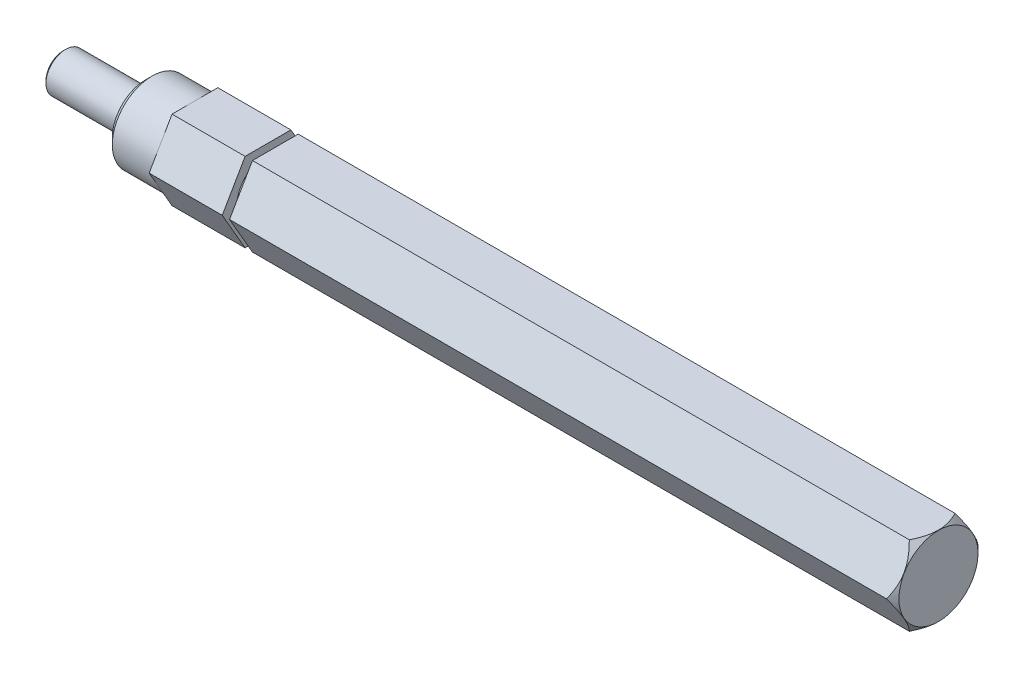
ISO-10303-21;
HEADER;
FILE_DESCRIPTION(('STEP AP214'),'2;1');
FILE_NAME('part.step','',(''),(''),'','','');
FILE_SCHEMA(('AUTOMOTIVE_DESIGN { 1 0 10303 214 1 1 1 1 }'));
ENDSEC;
DATA;
#1=APPLICATION_CONTEXT('core data for automotive mechanical design processes');
#2=APPLICATION_PROTOCOL_DEFINITION('international standard','automotive_design',2000,#1);
#3=PRODUCT_CONTEXT('',#1,'mechanical');
#4=PRODUCT('Part','Part','',(#3));
#5=PRODUCT_RELATED_PRODUCT_CATEGORY('part','',(#4));
#6=PRODUCT_DEFINITION_FORMATION('','',#4);
#7=PRODUCT_DEFINITION_CONTEXT('part definition',#1,'design');
#8=PRODUCT_DEFINITION('design','',#6,#7);
#9=PRODUCT_DEFINITION_SHAPE('','',#8);
#10=(LENGTH_UNIT() NAMED_UNIT(*) SI_UNIT(.MILLI.,.METRE.));
#11=(NAMED_UNIT(*) PLANE_ANGLE_UNIT() SI_UNIT($,.RADIAN.));
#12=(NAMED_UNIT(*) SI_UNIT($,.STERADIAN.) SOLID_ANGLE_UNIT());
#13=UNCERTAINTY_MEASURE_WITH_UNIT(LENGTH_MEASURE(1.E-05),#10,'distance_accuracy_value','');
#14=(GEOMETRIC_REPRESENTATION_CONTEXT(3) GLOBAL_UNCERTAINTY_ASSIGNED_CONTEXT((#13)) GLOBAL_UNIT_ASSIGNED_CONTEXT((#10,
#11,#12)) REPRESENTATION_CONTEXT('',''));
#15=CARTESIAN_POINT('',(0.,0.,0.));
#16=DIRECTION('',(0.,0.,1.));
#17=DIRECTION('',(1.,0.,0.));
#18=AXIS2_PLACEMENT_3D('',#15,#16,#17);
#19=CARTESIAN_POINT('',(-76.708,0.,0.));
#20=DIRECTION('',(-1.,0.,0.));
#21=DIRECTION('',(0.,0.,1.));
#22=AXIS2_PLACEMENT_3D('',#19,#20,#21);
#23=PLANE('',#22);
#24=CARTESIAN_POINT('',(-76.7079999999964,0.,0.));
#25=DIRECTION('',(1.,0.,0.));
#26=DIRECTION('',(0.,0.,-1.));
#27=AXIS2_PLACEMENT_3D('',#24,#25,#26);
#28=CIRCLE('',#27,2.76860000002443);
#29=CARTESIAN_POINT('',(-76.7079999999964,0.,-2.76860000002443));
#30=VERTEX_POINT('',#29);
#31=EDGE_CURVE('E21',#30,#30,#28,.T.);
#32=ORIENTED_EDGE('',*,*,#31,.F.);
#33=EDGE_LOOP('',(#32));
#34=FACE_BOUND('',#33,.T.);
#35=ADVANCED_FACE('F18',(#34),#23,.T.);
#36=CARTESIAN_POINT('',(-76.326999999992,0.,0.));
#37=DIRECTION('',(1.,0.,0.));
#38=DIRECTION('',(0.,0.,-1.));
#39=AXIS2_PLACEMENT_3D('',#36,#37,#38);
#40=CONICAL_SURFACE('',#39,3.149599999972,0.785398163322851);
#41=ORIENTED_EDGE('',*,*,#31,.T.);
#42=EDGE_LOOP('',(#41));
#43=FACE_BOUND('',#42,.T.);
#44=CARTESIAN_POINT('',(-76.327,0.,0.));
#45=DIRECTION('',(1.,0.,0.));
#46=DIRECTION('',(0.,0.,-1.));
#47=AXIS2_PLACEMENT_3D('',#44,#45,#46);
#48=CIRCLE('',#47,3.1496);
#49=CARTESIAN_POINT('',(-76.327,0.,-3.1496));
#50=VERTEX_POINT('',#49);
#51=EDGE_CURVE('E134',#50,#50,#48,.T.);
#52=ORIENTED_EDGE('',*,*,#51,.F.);
#53=EDGE_LOOP('',(#52));
#54=FACE_BOUND('',#53,.T.);
#55=ADVANCED_FACE('F260',(#43,#54),#40,.T.);
#56=CARTESIAN_POINT('',(-76.708,0.,0.));
#57=DIRECTION('',(1.,0.,0.));
#58=DIRECTION('',(0.,0.,-1.));
#59=AXIS2_PLACEMENT_3D('',#56,#57,#58);
#60=CYLINDRICAL_SURFACE('',#59,3.1496);
#61=ORIENTED_EDGE('',*,*,#51,.T.);
#62=EDGE_LOOP('',(#61));
#63=FACE_BOUND('',#62,.T.);
#64=CARTESIAN_POINT('',(-63.5,0.,0.));
#65=DIRECTION('',(1.,0.,0.));
#66=DIRECTION('',(0.,0.,-1.));
#67=AXIS2_PLACEMENT_3D('',#64,#65,#66);
#68=CIRCLE('',#67,3.1496);
#69=CARTESIAN_POINT('',(-63.5,0.,-3.1496));
#70=VERTEX_POINT('',#69);
#71=EDGE_CURVE('E137',#70,#70,#68,.F.);
#72=ORIENTED_EDGE('',*,*,#71,.T.);
#73=EDGE_LOOP('',(#72));
#74=FACE_BOUND('',#73,.T.);
#75=ADVANCED_FACE('F257',(#63,#74),#60,.T.);
#76=CARTESIAN_POINT('',(-63.5,0.,-7.33234841870824));
#77=DIRECTION('',(1.,0.,0.));
#78=DIRECTION('',(0.,0.,-1.));
#79=AXIS2_PLACEMENT_3D('',#76,#77,#78);
#80=PLANE('',#79);
#81=ORIENTED_EDGE('',*,*,#71,.F.);
#82=EDGE_LOOP('',(#81));
#83=FACE_BOUND('',#82,.T.);
#84=CARTESIAN_POINT('',(-63.4999999999764,0.,0.));
#85=DIRECTION('',(1.,0.,0.));
#86=DIRECTION('',(0.,0.,-1.));
#87=AXIS2_PLACEMENT_3D('',#84,#85,#86);
#88=CIRCLE('',#87,5.35000000002128);
#89=CARTESIAN_POINT('',(-63.4999999999764,0.,-5.35000000002128));
#90=VERTEX_POINT('',#89);
#91=EDGE_CURVE('E133',#90,#90,#88,.T.);
#92=ORIENTED_EDGE('',*,*,#91,.F.);
#93=EDGE_LOOP('',(#92));
#94=FACE_BOUND('',#93,.T.);
#95=ADVANCED_FACE('F253',(#83,#94),#80,.F.);
#96=CARTESIAN_POINT('',(-62.5000000001137,0.,0.));
#97=DIRECTION('',(1.,0.,0.));
#98=DIRECTION('',(0.,0.,-1.));
#99=AXIS2_PLACEMENT_3D('',#96,#97,#98);
#100=CONICAL_SURFACE('',#99,6.34999999988395,0.785398163397448);
#101=ORIENTED_EDGE('',*,*,#91,.T.);
#102=EDGE_LOOP('',(#101));
#103=FACE_BOUND('',#102,.T.);
#104=CARTESIAN_POINT('',(-62.5,0.,0.));
#105=DIRECTION('',(-1.,0.,0.));
#106=DIRECTION('',(0.,0.,1.));
#107=AXIS2_PLACEMENT_3D('',#104,#105,#106);
#108=CIRCLE('',#107,6.35);
#109=CARTESIAN_POINT('',(-62.5,0.,6.35));
#110=VERTEX_POINT('',#109);
#111=EDGE_CURVE('E97',#110,#110,#108,.F.);
#112=ORIENTED_EDGE('',*,*,#111,.F.);
#113=EDGE_LOOP('',(#112));
#114=FACE_BOUND('',#113,.T.);
#115=ADVANCED_FACE('F250',(#103,#114),#100,.T.);
#116=CARTESIAN_POINT('',(-55.6133,0.,0.));
#117=DIRECTION('',(-1.,0.,0.));
#118=DIRECTION('',(0.,0.,1.));
#119=AXIS2_PLACEMENT_3D('',#116,#117,#118);
#120=CYLINDRICAL_SURFACE('',#119,6.35);
#121=CARTESIAN_POINT('',(-55.6133,0.,0.));
#122=DIRECTION('',(-1.,0.,0.));
#123=DIRECTION('',(0.,0.,1.));
#124=AXIS2_PLACEMENT_3D('',#121,#122,#123);
#125=CIRCLE('',#124,6.35);
#126=CARTESIAN_POINT('',(-55.6133,-3.17499999999999,-5.49926131403119));
#127=VERTEX_POINT('',#126);
#128=CARTESIAN_POINT('',(-55.6133,3.175,-5.49926131403119));
#129=VERTEX_POINT('',#128);
#130=EDGE_CURVE('E83',#127,#129,#125,.F.);
#131=ORIENTED_EDGE('',*,*,#130,.F.);
#132=CARTESIAN_POINT('',(-55.6133,0.,0.));
#133=DIRECTION('',(-1.,0.,0.));
#134=DIRECTION('',(0.,0.,1.));
#135=AXIS2_PLACEMENT_3D('',#132,#133,#134);
#136=CIRCLE('',#135,6.35);
#137=CARTESIAN_POINT('',(-55.6133,-6.35000000000001,0.));
#138=VERTEX_POINT('',#137);
#139=EDGE_CURVE('E92',#138,#127,#136,.F.);
#140=ORIENTED_EDGE('',*,*,#139,.F.);
#141=CARTESIAN_POINT('',(-55.6133,0.,0.));
#142=DIRECTION('',(-1.,0.,0.));
#143=DIRECTION('',(0.,0.,1.));
#144=AXIS2_PLACEMENT_3D('',#141,#142,#143);
#145=CIRCLE('',#144,6.35);
#146=CARTESIAN_POINT('',(-55.6133,-3.175,5.49926131403118));
#147=VERTEX_POINT('',#146);
#148=EDGE_CURVE('E107',#147,#138,#145,.F.);
#149=ORIENTED_EDGE('',*,*,#148,.F.);
#150=CARTESIAN_POINT('',(-55.6133,0.,0.));
#151=DIRECTION('',(-1.,0.,0.));
#152=DIRECTION('',(0.,0.,1.));
#153=AXIS2_PLACEMENT_3D('',#150,#151,#152);
#154=CIRCLE('',#153,6.35);
#155=CARTESIAN_POINT('',(-55.6133,3.17499999999999,5.49926131403118));
#156=VERTEX_POINT('',#155);
#157=EDGE_CURVE('E108',#156,#147,#154,.F.);
#158=ORIENTED_EDGE('',*,*,#157,.F.);
#159=CARTESIAN_POINT('',(-55.6133,0.,0.));
#160=DIRECTION('',(-1.,0.,0.));
#161=DIRECTION('',(0.,0.,1.));
#162=AXIS2_PLACEMENT_3D('',#159,#160,#161);
#163=CIRCLE('',#162,6.35);
#164=CARTESIAN_POINT('',(-55.6133,6.35,0.));
#165=VERTEX_POINT('',#164);
#166=EDGE_CURVE('E458',#165,#156,#163,.F.);
#167=ORIENTED_EDGE('',*,*,#166,.F.);
#168=CARTESIAN_POINT('',(-55.6133,0.,0.));
#169=DIRECTION('',(-1.,0.,0.));
#170=DIRECTION('',(0.,0.,1.));
#171=AXIS2_PLACEMENT_3D('',#168,#169,#170);
#172=CIRCLE('',#171,6.35);
#173=EDGE_CURVE('E95',#129,#165,#172,.F.);
#174=ORIENTED_EDGE('',*,*,#173,.F.);
#175=EDGE_LOOP('',(#131,#140,#149,#158,#167,#174));
#176=FACE_BOUND('',#175,.T.);
#177=ORIENTED_EDGE('',*,*,#111,.T.);
#178=EDGE_LOOP('',(#177));
#179=FACE_BOUND('',#178,.T.);
#180=ADVANCED_FACE('F89',(#176,#179),#120,.T.);
#181=CARTESIAN_POINT('',(-55.6133,0.,0.));
#182=DIRECTION('',(-1.,0.,0.));
#183=DIRECTION('',(0.,0.,1.));
#184=AXIS2_PLACEMENT_3D('',#181,#182,#183);
#185=PLANE('',#184);
#186=DIRECTION('',(0.,-0.86602540378444,0.499999999999999));
#187=VECTOR('',#186,1.);
#188=CARTESIAN_POINT('',(-55.6133000000001,-6.35000000000002,-3.66617420935411));
#189=LINE('',#188,#187);
#190=CARTESIAN_POINT('',(-55.6133000000001,0.,-7.33234841870823));
#191=VERTEX_POINT('',#190);
#192=EDGE_CURVE('E114',#191,#127,#189,.T.);
#193=ORIENTED_EDGE('',*,*,#192,.T.);
#194=ORIENTED_EDGE('',*,*,#130,.T.);
#195=DIRECTION('',(0.,-0.866025403784439,-0.5));
#196=VECTOR('',#195,1.);
#197=CARTESIAN_POINT('',(-55.6133000000001,0.,-7.33234841870824));
#198=LINE('',#197,#196);
#199=EDGE_CURVE('E122',#129,#191,#198,.T.);
#200=ORIENTED_EDGE('',*,*,#199,.T.);
#201=EDGE_LOOP('',(#193,#194,#200));
#202=FACE_BOUND('',#201,.T.);
#203=ADVANCED_FACE('F121',(#202),#185,.T.);
#204=CARTESIAN_POINT('',(-55.6133,0.,0.));
#205=DIRECTION('',(-1.,0.,0.));
#206=DIRECTION('',(0.,0.,1.));
#207=AXIS2_PLACEMENT_3D('',#204,#205,#206);
#208=PLANE('',#207);
#209=DIRECTION('',(0.,-0.866025403784439,-0.5));
#210=VECTOR('',#209,1.);
#211=CARTESIAN_POINT('',(-55.6133000000001,0.,-7.33234841870824));
#212=LINE('',#211,#210);
#213=CARTESIAN_POINT('',(-55.6133,6.35000000000001,-3.66617420935409));
#214=VERTEX_POINT('',#213);
#215=EDGE_CURVE('E119',#214,#129,#212,.T.);
#216=ORIENTED_EDGE('',*,*,#215,.T.);
#217=ORIENTED_EDGE('',*,*,#173,.T.);
#218=DIRECTION('',(0.,0.,-1.));
#219=VECTOR('',#218,1.);
#220=CARTESIAN_POINT('',(-55.6133,6.35,-3.66617420935412));
#221=LINE('',#220,#219);
#222=EDGE_CURVE('E417',#165,#214,#221,.T.);
#223=ORIENTED_EDGE('',*,*,#222,.T.);
#224=EDGE_LOOP('',(#216,#217,#223));
#225=FACE_BOUND('',#224,.T.);
#226=ADVANCED_FACE('F241',(#225),#208,.T.);
#227=CARTESIAN_POINT('',(-55.6133,0.,0.));
#228=DIRECTION('',(-1.,0.,0.));
#229=DIRECTION('',(0.,0.,1.));
#230=AXIS2_PLACEMENT_3D('',#227,#228,#229);
#231=PLANE('',#230);
#232=ORIENTED_EDGE('',*,*,#166,.T.);
#233=DIRECTION('',(0.,0.866025403784439,-0.499999999999999));
#234=VECTOR('',#233,1.);
#235=CARTESIAN_POINT('',(-55.6133,6.35,3.6661742093541));
#236=LINE('',#235,#234);
#237=CARTESIAN_POINT('',(-55.6133,6.34999999999999,3.66617420935411));
#238=VERTEX_POINT('',#237);
#239=EDGE_CURVE('E402',#156,#238,#236,.T.);
#240=ORIENTED_EDGE('',*,*,#239,.T.);
#241=DIRECTION('',(0.,0.,-1.));
#242=VECTOR('',#241,1.);
#243=CARTESIAN_POINT('',(-55.6133,6.35,-3.66617420935412));
#244=LINE('',#243,#242);
#245=EDGE_CURVE('E414',#238,#165,#244,.T.);
#246=ORIENTED_EDGE('',*,*,#245,.T.);
#247=EDGE_LOOP('',(#232,#240,#246));
#248=FACE_BOUND('',#247,.T.);
#249=ADVANCED_FACE('F237',(#248),#231,.T.);
#250=CARTESIAN_POINT('',(-55.6133,0.,0.));
#251=DIRECTION('',(-1.,0.,0.));
#252=DIRECTION('',(0.,0.,1.));
#253=AXIS2_PLACEMENT_3D('',#250,#251,#252);
#254=PLANE('',#253);
#255=ORIENTED_EDGE('',*,*,#157,.T.);
#256=DIRECTION('',(0.,0.866025403784439,0.5));
#257=VECTOR('',#256,1.);
#258=CARTESIAN_POINT('',(-55.6133,0.,7.33234841870822));
#259=LINE('',#258,#257);
#260=CARTESIAN_POINT('',(-55.6133,0.,7.33234841870822));
#261=VERTEX_POINT('',#260);
#262=EDGE_CURVE('E373',#147,#261,#259,.T.);
#263=ORIENTED_EDGE('',*,*,#262,.T.);
#264=DIRECTION('',(0.,0.866025403784439,-0.499999999999999));
#265=VECTOR('',#264,1.);
#266=CARTESIAN_POINT('',(-55.6133,6.35,3.6661742093541));
#267=LINE('',#266,#265);
#268=EDGE_CURVE('E399',#261,#156,#267,.T.);
#269=ORIENTED_EDGE('',*,*,#268,.T.);
#270=EDGE_LOOP('',(#255,#263,#269));
#271=FACE_BOUND('',#270,.T.);
#272=ADVANCED_FACE('F234',(#271),#254,.T.);
#273=CARTESIAN_POINT('',(-55.6133,0.,0.));
#274=DIRECTION('',(-1.,0.,0.));
#275=DIRECTION('',(0.,0.,1.));
#276=AXIS2_PLACEMENT_3D('',#273,#274,#275);
#277=PLANE('',#276);
#278=DIRECTION('',(0.,0.,1.));
#279=VECTOR('',#278,1.);
#280=CARTESIAN_POINT('',(-55.6133,-6.35000000000002,3.66617420935409));
#281=LINE('',#280,#279);
#282=CARTESIAN_POINT('',(-55.6133,-6.35000000000003,-3.6661742093541));
#283=VERTEX_POINT('',#282);
#284=EDGE_CURVE('E106',#283,#138,#281,.T.);
#285=ORIENTED_EDGE('',*,*,#284,.T.);
#286=ORIENTED_EDGE('',*,*,#139,.T.);
#287=DIRECTION('',(0.,-0.86602540378444,0.499999999999999));
#288=VECTOR('',#287,1.);
#289=CARTESIAN_POINT('',(-55.6133000000001,-6.35000000000002,-3.66617420935411));
#290=LINE('',#289,#288);
#291=EDGE_CURVE('E104',#127,#283,#290,.T.);
#292=ORIENTED_EDGE('',*,*,#291,.T.);
#293=EDGE_LOOP('',(#285,#286,#292));
#294=FACE_BOUND('',#293,.T.);
#295=ADVANCED_FACE('F103',(#294),#277,.T.);
#296=CARTESIAN_POINT('',(-55.6133,0.,0.));
#297=DIRECTION('',(-1.,0.,0.));
#298=DIRECTION('',(0.,0.,1.));
#299=AXIS2_PLACEMENT_3D('',#296,#297,#298);
#300=PLANE('',#299);
#301=ORIENTED_EDGE('',*,*,#148,.T.);
#302=DIRECTION('',(0.,0.,1.));
#303=VECTOR('',#302,1.);
#304=CARTESIAN_POINT('',(-55.6133,-6.35000000000002,3.66617420935409));
#305=LINE('',#304,#303);
#306=CARTESIAN_POINT('',(-55.6133,-6.35000000000002,3.66617420935407));
#307=VERTEX_POINT('',#306);
#308=EDGE_CURVE('E358',#138,#307,#305,.T.);
#309=ORIENTED_EDGE('',*,*,#308,.T.);
#310=DIRECTION('',(0.,0.866025403784439,0.5));
#311=VECTOR('',#310,1.);
#312=CARTESIAN_POINT('',(-55.6133,0.,7.33234841870822));
#313=LINE('',#312,#311);
#314=EDGE_CURVE('E370',#307,#147,#313,.T.);
#315=ORIENTED_EDGE('',*,*,#314,.T.);
#316=EDGE_LOOP('',(#301,#309,#315));
#317=FACE_BOUND('',#316,.T.);
#318=ADVANCED_FACE('F228',(#317),#300,.T.);
#319=CARTESIAN_POINT('',(63.5,-6.35000000000002,-3.66617420935411));
#320=DIRECTION('',(0.,0.499999999999999,0.86602540378444));
#321=DIRECTION('',(0.,-0.86602540378444,0.499999999999999));
#322=AXIS2_PLACEMENT_3D('',#319,#320,#321);
#323=PLANE('',#322);
#324=DIRECTION('',(1.,0.,0.));
#325=VECTOR('',#324,1.);
#326=CARTESIAN_POINT('',(63.5,-6.35000000000002,-3.66617420935411));
#327=LINE('',#326,#325);
#328=CARTESIAN_POINT('',(-43.9039,-6.35000000000002,-3.66617420935411));
#329=VERTEX_POINT('',#328);
#330=EDGE_CURVE('E118',#329,#283,#327,.F.);
#331=ORIENTED_EDGE('',*,*,#330,.T.);
#332=ORIENTED_EDGE('',*,*,#291,.F.);
#333=ORIENTED_EDGE('',*,*,#192,.F.);
#334=DIRECTION('',(1.,0.,0.));
#335=VECTOR('',#334,1.);
#336=CARTESIAN_POINT('',(63.5,0.,-7.33234841870822));
#337=LINE('',#336,#335);
#338=CARTESIAN_POINT('',(-43.9039,0.,-7.33234841870823));
#339=VERTEX_POINT('',#338);
#340=EDGE_CURVE('E418',#191,#339,#337,.T.);
#341=ORIENTED_EDGE('',*,*,#340,.T.);
#342=DIRECTION('',(0.,0.86602540378444,-0.499999999999999));
#343=VECTOR('',#342,1.);
#344=CARTESIAN_POINT('',(-43.9039,-6.35000000000002,-3.66617420935411));
#345=LINE('',#344,#343);
#346=EDGE_CURVE('E356',#329,#339,#345,.T.);
#347=ORIENTED_EDGE('',*,*,#346,.F.);
#348=EDGE_LOOP('',(#331,#332,#333,#341,#347));
#349=FACE_BOUND('',#348,.T.);
#350=ADVANCED_FACE('F112',(#349),#323,.F.);
#351=CARTESIAN_POINT('',(63.5,0.,-7.33234841870824));
#352=DIRECTION('',(0.,-0.5,0.866025403784439));
#353=DIRECTION('',(0.,-0.866025403784439,-0.5));
#354=AXIS2_PLACEMENT_3D('',#351,#352,#353);
#355=PLANE('',#354);
#356=ORIENTED_EDGE('',*,*,#340,.F.);
#357=ORIENTED_EDGE('',*,*,#199,.F.);
#358=ORIENTED_EDGE('',*,*,#215,.F.);
#359=DIRECTION('',(1.,0.,0.));
#360=VECTOR('',#359,1.);
#361=CARTESIAN_POINT('',(63.5,6.35,-3.66617420935407));
#362=LINE('',#361,#360);
#363=CARTESIAN_POINT('',(-43.9039,6.35,-3.66617420935411));
#364=VERTEX_POINT('',#363);
#365=EDGE_CURVE('E403',#214,#364,#362,.T.);
#366=ORIENTED_EDGE('',*,*,#365,.T.);
#367=DIRECTION('',(0.,0.866025403784439,0.5));
#368=VECTOR('',#367,1.);
#369=CARTESIAN_POINT('',(-43.9039,0.,-7.33234841870824));
#370=LINE('',#369,#368);
#371=EDGE_CURVE('E353',#339,#364,#370,.T.);
#372=ORIENTED_EDGE('',*,*,#371,.F.);
#373=EDGE_LOOP('',(#356,#357,#358,#366,#372));
#374=FACE_BOUND('',#373,.T.);
#375=ADVANCED_FACE('F221',(#374),#355,.F.);
#376=CARTESIAN_POINT('',(63.5,6.35,-3.66617420935412));
#377=DIRECTION('',(0.,-1.,0.));
#378=DIRECTION('',(0.,0.,-1.));
#379=AXIS2_PLACEMENT_3D('',#376,#377,#378);
#380=PLANE('',#379);
#381=ORIENTED_EDGE('',*,*,#365,.F.);
#382=ORIENTED_EDGE('',*,*,#222,.F.);
#383=ORIENTED_EDGE('',*,*,#245,.F.);
#384=DIRECTION('',(1.,0.,0.));
#385=VECTOR('',#384,1.);
#386=CARTESIAN_POINT('',(63.5,6.34999999999997,3.66617420935412));
#387=LINE('',#386,#385);
#388=CARTESIAN_POINT('',(-43.9039,6.34999999999999,3.6661742093541));
#389=VERTEX_POINT('',#388);
#390=EDGE_CURVE('E374',#238,#389,#387,.T.);
#391=ORIENTED_EDGE('',*,*,#390,.T.);
#392=DIRECTION('',(0.,0.,-1.));
#393=VECTOR('',#392,1.);
#394=CARTESIAN_POINT('',(-43.9039,6.35,0.));
#395=LINE('',#394,#393);
#396=EDGE_CURVE('E350',#364,#389,#395,.F.);
#397=ORIENTED_EDGE('',*,*,#396,.F.);
#398=EDGE_LOOP('',(#381,#382,#383,#391,#397));
#399=FACE_BOUND('',#398,.T.);
#400=ADVANCED_FACE('F217',(#399),#380,.F.);
#401=CARTESIAN_POINT('',(63.5,6.35,3.6661742093541));
#402=DIRECTION('',(0.,-0.499999999999999,-0.866025403784439));
#403=DIRECTION('',(0.,0.866025403784439,-0.499999999999999));
#404=AXIS2_PLACEMENT_3D('',#401,#402,#403);
#405=PLANE('',#404);
#406=ORIENTED_EDGE('',*,*,#390,.F.);
#407=ORIENTED_EDGE('',*,*,#239,.F.);
#408=ORIENTED_EDGE('',*,*,#268,.F.);
#409=DIRECTION('',(1.,0.,0.));
#410=VECTOR('',#409,1.);
#411=CARTESIAN_POINT('',(63.5,0.,7.33234841870822));
#412=LINE('',#411,#410);
#413=CARTESIAN_POINT('',(-43.9039,0.,7.33234841870822));
#414=VERTEX_POINT('',#413);
#415=EDGE_CURVE('E378',#261,#414,#412,.T.);
#416=ORIENTED_EDGE('',*,*,#415,.T.);
#417=DIRECTION('',(0.,-0.866025403784439,0.499999999999999));
#418=VECTOR('',#417,1.);
#419=CARTESIAN_POINT('',(-43.9039,6.35,3.6661742093541));
#420=LINE('',#419,#418);
#421=EDGE_CURVE('E347',#389,#414,#420,.T.);
#422=ORIENTED_EDGE('',*,*,#421,.F.);
#423=EDGE_LOOP('',(#406,#407,#408,#416,#422));
#424=FACE_BOUND('',#423,.T.);
#425=ADVANCED_FACE('F213',(#424),#405,.F.);
#426=CARTESIAN_POINT('',(63.5,0.,7.33234841870822));
#427=DIRECTION('',(0.,0.5,-0.866025403784439));
#428=DIRECTION('',(0.,0.866025403784439,0.5));
#429=AXIS2_PLACEMENT_3D('',#426,#427,#428);
#430=PLANE('',#429);
#431=ORIENTED_EDGE('',*,*,#415,.F.);
#432=ORIENTED_EDGE('',*,*,#262,.F.);
#433=ORIENTED_EDGE('',*,*,#314,.F.);
#434=DIRECTION('',(1.,0.,0.));
#435=VECTOR('',#434,1.);
#436=CARTESIAN_POINT('',(63.5,-6.35000000000002,3.66617420935404));
#437=LINE('',#436,#435);
#438=CARTESIAN_POINT('',(-43.9039,-6.35000000000002,3.66617420935408));
#439=VERTEX_POINT('',#438);
#440=EDGE_CURVE('E363',#307,#439,#437,.T.);
#441=ORIENTED_EDGE('',*,*,#440,.T.);
#442=DIRECTION('',(0.,-0.866025403784439,-0.5));
#443=VECTOR('',#442,1.);
#444=CARTESIAN_POINT('',(-43.9039,0.,7.33234841870822));
#445=LINE('',#444,#443);
#446=EDGE_CURVE('E343',#414,#439,#445,.T.);
#447=ORIENTED_EDGE('',*,*,#446,.F.);
#448=EDGE_LOOP('',(#431,#432,#433,#441,#447));
#449=FACE_BOUND('',#448,.T.);
#450=ADVANCED_FACE('F209',(#449),#430,.F.);
#451=CARTESIAN_POINT('',(63.5,-6.35000000000002,3.66617420935409));
#452=DIRECTION('',(0.,1.,0.));
#453=DIRECTION('',(0.,0.,1.));
#454=AXIS2_PLACEMENT_3D('',#451,#452,#453);
#455=PLANE('',#454);
#456=ORIENTED_EDGE('',*,*,#440,.F.);
#457=ORIENTED_EDGE('',*,*,#308,.F.);
#458=ORIENTED_EDGE('',*,*,#284,.F.);
#459=ORIENTED_EDGE('',*,*,#330,.F.);
#460=DIRECTION('',(0.,0.,-1.));
#461=VECTOR('',#460,1.);
#462=CARTESIAN_POINT('',(-43.9039,-6.35000000000002,0.));
#463=LINE('',#462,#461);
#464=EDGE_CURVE('E346',#439,#329,#463,.T.);
#465=ORIENTED_EDGE('',*,*,#464,.F.);
#466=EDGE_LOOP('',(#456,#457,#458,#459,#465));
#467=FACE_BOUND('',#466,.T.);
#468=ADVANCED_FACE('F205',(#467),#455,.F.);
#469=CARTESIAN_POINT('',(-43.9039,7.5692,0.));
#470=DIRECTION('',(1.,0.,0.));
#471=DIRECTION('',(0.,0.,-1.));
#472=AXIS2_PLACEMENT_3D('',#469,#470,#471);
#473=PLANE('',#472);
#474=ORIENTED_EDGE('',*,*,#446,.T.);
#475=ORIENTED_EDGE('',*,*,#464,.T.);
#476=ORIENTED_EDGE('',*,*,#346,.T.);
#477=ORIENTED_EDGE('',*,*,#371,.T.);
#478=ORIENTED_EDGE('',*,*,#396,.T.);
#479=ORIENTED_EDGE('',*,*,#421,.T.);
#480=EDGE_LOOP('',(#474,#475,#476,#477,#478,#479));
#481=FACE_BOUND('',#480,.T.);
#482=CARTESIAN_POINT('',(-43.9039,0.,0.));
#483=DIRECTION('',(-1.,0.,0.));
#484=DIRECTION('',(0.,0.,1.));
#485=AXIS2_PLACEMENT_3D('',#482,#483,#484);
#486=CIRCLE('',#485,5.0292);
#487=CARTESIAN_POINT('',(-43.9039,0.,5.0292));
#488=VERTEX_POINT('',#487);
#489=EDGE_CURVE('E190',#488,#488,#486,.F.);
#490=ORIENTED_EDGE('',*,*,#489,.F.);
#491=EDGE_LOOP('',(#490));
#492=FACE_BOUND('',#491,.T.);
#493=ADVANCED_FACE('F201',(#481,#492),#473,.T.);
#494=CARTESIAN_POINT('',(-78.984221990192,0.,0.));
#495=DIRECTION('',(-1.,0.,0.));
#496=DIRECTION('',(0.,0.,1.));
#497=AXIS2_PLACEMENT_3D('',#494,#495,#496);
#498=CYLINDRICAL_SURFACE('',#497,5.0292);
#499=CARTESIAN_POINT('',(-42.7355,0.,0.));
#500=DIRECTION('',(-1.,0.,0.));
#501=DIRECTION('',(0.,0.,1.));
#502=AXIS2_PLACEMENT_3D('',#499,#500,#501);
#503=CIRCLE('',#502,5.0292);
#504=CARTESIAN_POINT('',(-42.7355,0.,5.0292));
#505=VERTEX_POINT('',#504);
#506=EDGE_CURVE('E322',#505,#505,#503,.F.);
#507=ORIENTED_EDGE('',*,*,#506,.F.);
#508=EDGE_LOOP('',(#507));
#509=FACE_BOUND('',#508,.T.);
#510=ORIENTED_EDGE('',*,*,#489,.T.);
#511=EDGE_LOOP('',(#510));
#512=FACE_BOUND('',#511,.T.);
#513=ADVANCED_FACE('F197',(#509,#512),#498,.T.);
#514=CARTESIAN_POINT('',(63.5,6.35,3.6661742093541));
#515=DIRECTION('',(0.,-0.499999999999999,-0.866025403784439));
#516=DIRECTION('',(0.,0.866025403784439,-0.499999999999999));
#517=AXIS2_PLACEMENT_3D('',#514,#515,#516);
#518=PLANE('',#517);
#519=CARTESIAN_POINT('',(62.5000000000251,6.35000000001244,3.66617420934359));
#520=CARTESIAN_POINT('',(62.5630243488132,6.24082224128488,3.72920801773657));
#521=CARTESIAN_POINT('',(62.6241144550649,6.13080532071174,3.79272631644577));
#522=CARTESIAN_POINT('',(62.7418378426298,5.90892855599336,3.92082692628353));
#523=CARTESIAN_POINT('',(62.7984686901009,5.79706774518943,3.98540979551273));
#524=CARTESIAN_POINT('',(62.9612726486637,5.45743359870879,4.18149766140896));
#525=CARTESIAN_POINT('',(63.0596627844808,5.22678528314501,4.31466252848802));
#526=CARTESIAN_POINT('',(63.2281485575353,4.76166466154774,4.58320004457297));
#527=CARTESIAN_POINT('',(63.2986686148327,4.52731120638811,4.71850407499485));
#528=CARTESIAN_POINT('',(63.3802425803222,4.17192864306111,4.92368429359698));
#529=CARTESIAN_POINT('',(63.4033886424388,4.05294462116125,4.99237975067012));
#530=CARTESIAN_POINT('',(63.4410883456707,3.8139692669545,5.13035223575108));
#531=CARTESIAN_POINT('',(63.4556432705365,3.69397808786348,5.19962917529966));
#532=CARTESIAN_POINT('',(63.4800473333972,3.4015656735228,5.36845356143364));
#533=CARTESIAN_POINT('',(63.4851670463066,3.22882935730443,5.46818292010114));
#534=CARTESIAN_POINT('',(63.4765691176406,2.88366816817395,5.66746182555943));
#535=CARTESIAN_POINT('',(63.4628448734034,2.71124342563287,5.76701129708048));
#536=CARTESIAN_POINT('',(63.4173680224393,2.36801965567891,5.96517163305567));
#537=CARTESIAN_POINT('',(63.3855952591375,2.19722266334729,6.06378132255512));
#538=CARTESIAN_POINT('',(63.3057487124252,1.85856430449202,6.25930581720352));
#539=CARTESIAN_POINT('',(63.2576761791711,1.69070271386755,6.35622075173716));
#540=CARTESIAN_POINT('',(63.1587833928241,1.39273873571613,6.52825033473169));
#541=CARTESIAN_POINT('',(63.1105654677278,1.26197616672401,6.60374613913922));
#542=CARTESIAN_POINT('',(63.0063605790637,1.00279800721751,6.75338271929837));
#543=CARTESIAN_POINT('',(62.9503733812648,0.874382487595069,6.82752345412051));
#544=CARTESIAN_POINT('',(62.8318846841198,0.620302927697585,6.9742163564229));
#545=CARTESIAN_POINT('',(62.7694036729165,0.494631661690758,7.04677269568135));
#546=CARTESIAN_POINT('',(62.6387473881741,0.245615832684061,7.19054205159084));
#547=CARTESIAN_POINT('',(62.57057560442,0.122269899780837,7.26175585915596));
#548=CARTESIAN_POINT('',(62.5000000000243,-1.81008379892415E-11,7.33234841871867));
#549=B_SPLINE_CURVE_WITH_KNOTS('',3,(#519,#520,#521,#522,#523,#524,#525,#526,#527,#528,#529,
#530,#531,#532,#533,#534,#535,#536,#537,#538,#539,#540,#541,#542,#543,#544,#545,#546,#547,#548),
.UNSPECIFIED.,.F.,.F.,(4,2,2,2,2,2,2,2,2,2,2,2,2,2,4),(0.,0.422806209108108,0.845841606931469,
1.69647868442685,2.53361052128564,2.95135562071456,3.36903828181059,3.96668147991981,
4.56453413738439,5.16305579271072,5.76153155312969,6.23681974407244,6.71212226731044,
7.18596827579815,7.65952581009692),.UNSPECIFIED.);
#550=CARTESIAN_POINT('',(62.5000000000306,6.35000000000721,3.66617420934992));
#551=VERTEX_POINT('',#550);
#552=CARTESIAN_POINT('',(62.5000000000406,-9.00413111396634E-12,7.33234841870221));
#553=VERTEX_POINT('',#552);
#554=EDGE_CURVE('E183',#551,#553,#549,.T.);
#555=ORIENTED_EDGE('',*,*,#554,.F.);
#556=DIRECTION('',(1.,0.,0.));
#557=VECTOR('',#556,1.);
#558=CARTESIAN_POINT('',(63.5,6.35,3.66617420935407));
#559=LINE('',#558,#557);
#560=CARTESIAN_POINT('',(-42.7355,6.35,3.66617420935409));
#561=VERTEX_POINT('',#560);
#562=EDGE_CURVE('E319',#551,#561,#559,.F.);
#563=ORIENTED_EDGE('',*,*,#562,.T.);
#564=DIRECTION('',(0.,0.866025403784439,-0.499999999999999));
#565=VECTOR('',#564,1.);
#566=CARTESIAN_POINT('',(-42.7355,0.,7.33234841870822));
#567=LINE('',#566,#565);
#568=CARTESIAN_POINT('',(-42.7355,0.,7.33234841870822));
#569=VERTEX_POINT('',#568);
#570=EDGE_CURVE('E327',#569,#561,#567,.T.);
#571=ORIENTED_EDGE('',*,*,#570,.F.);
#572=DIRECTION('',(1.,0.,0.));
#573=VECTOR('',#572,1.);
#574=CARTESIAN_POINT('',(63.5,0.,7.33234841870822));
#575=LINE('',#574,#573);
#576=EDGE_CURVE('E189',#569,#553,#575,.T.);
#577=ORIENTED_EDGE('',*,*,#576,.T.);
#578=EDGE_LOOP('',(#555,#563,#571,#577));
#579=FACE_BOUND('',#578,.T.);
#580=ADVANCED_FACE('F191',(#579),#518,.F.);
#581=CARTESIAN_POINT('',(63.5,0.,-7.33234841870824));
#582=DIRECTION('',(1.,0.,0.));
#583=DIRECTION('',(0.,0.,-1.));
#584=AXIS2_PLACEMENT_3D('',#581,#582,#583);
#585=PLANE('',#584);
#586=CARTESIAN_POINT('',(63.5000000000332,0.,0.));
#587=DIRECTION('',(-1.,0.,0.));
#588=DIRECTION('',(0.,0.,1.));
#589=AXIS2_PLACEMENT_3D('',#586,#587,#588);
#590=CIRCLE('',#589,6.33234841876629);
#591=CARTESIAN_POINT('',(63.5000000000332,0.,6.33234841876629));
#592=VERTEX_POINT('',#591);
#593=EDGE_CURVE('E312',#592,#592,#590,.T.);
#594=ORIENTED_EDGE('',*,*,#593,.F.);
#595=EDGE_LOOP('',(#594));
#596=FACE_BOUND('',#595,.T.);
#597=ADVANCED_FACE('F196',(#596),#585,.T.);
#598=CARTESIAN_POINT('',(63.5,0.,7.33234841870822));
#599=DIRECTION('',(0.,0.5,-0.866025403784439));
#600=DIRECTION('',(0.,0.866025403784439,0.5));
#601=AXIS2_PLACEMENT_3D('',#598,#599,#600);
#602=PLANE('',#601);
#603=CARTESIAN_POINT('',(62.5000000000249,1.75925298986051E-11,7.3323484187199));
#604=CARTESIAN_POINT('',(62.5630243487969,-0.109177758685032,7.26931461034246));
#605=CARTESIAN_POINT('',(62.6241144550341,-0.219194679232282,7.20579631164868));
#606=CARTESIAN_POINT('',(62.7418378425729,-0.441071443897425,7.07769570184204));
#607=CARTESIAN_POINT('',(62.7984686900325,-0.552932254674009,7.0131128326285));
#608=CARTESIAN_POINT('',(62.9612726485645,-0.892566401071536,6.81702496678006));
#609=CARTESIAN_POINT('',(63.0596627843665,-1.12321471657826,6.68386009973405));
#610=CARTESIAN_POINT('',(63.2281485574468,-1.58833533816983,6.41532258365245));
#611=CARTESIAN_POINT('',(63.2986686147724,-1.82268879338437,6.28001855319884));
#612=CARTESIAN_POINT('',(63.3802425802934,-2.17807135679596,6.07483833454786));
#613=CARTESIAN_POINT('',(63.4033886424187,-2.29705537872428,6.00614287745829));
#614=CARTESIAN_POINT('',(63.4410883456639,-2.53603073298853,5.86817039234413));
#615=CARTESIAN_POINT('',(63.4556432705342,-2.65602191210859,5.79889345277879));
#616=CARTESIAN_POINT('',(63.480047333399,-2.94843432649882,5.6300690666162));
#617=CARTESIAN_POINT('',(63.4851670463078,-3.1211706427377,5.53033970793686));
#618=CARTESIAN_POINT('',(63.4765691176362,-3.46633183190934,5.3310608024548));
#619=CARTESIAN_POINT('',(63.462844873394,-3.63875657447107,5.23151133092183));
#620=CARTESIAN_POINT('',(63.4173680224212,-3.98198034442485,5.03335099494674));
#621=CARTESIAN_POINT('',(63.38559525912,-4.15277733673607,4.93474130545908));
#622=CARTESIAN_POINT('',(63.3057487124129,-4.491435695551,4.73921681083396));
#623=CARTESIAN_POINT('',(63.2576761791634,-4.65929728615555,4.64230187631183));
#624=CARTESIAN_POINT('',(63.1587833946501,-4.9572612587822,4.47027229650702));
#625=CARTESIAN_POINT('',(63.1105654717515,-5.08802382236376,4.39477649522328));
#626=CARTESIAN_POINT('',(63.0063605880871,-5.34720197124372,4.24513992119936));
#627=CARTESIAN_POINT('',(62.9503733930904,-5.47561748565031,4.1709991893886));
#628=CARTESIAN_POINT('',(62.8318847020052,-5.72969703534421,4.02430629297725));
#629=CARTESIAN_POINT('',(62.7694036940571,-5.85536829636237,3.95174995659901));
#630=CARTESIAN_POINT('',(62.638747416183,-6.10438411558181,3.80798060634019));
#631=CARTESIAN_POINT('',(62.5705756360411,-6.2277300436861,3.73676680154573));
#632=CARTESIAN_POINT('',(62.5000000353897,-6.34999993876339,3.66617424470908));
#633=B_SPLINE_CURVE_WITH_KNOTS('',3,(#603,#604,#605,#606,#607,#608,#609,#610,#611,#612,#613,
#614,#615,#616,#617,#618,#619,#620,#621,#622,#623,#624,#625,#626,#627,#628,#629,#630,#631,#632),
.UNSPECIFIED.,.F.,.F.,(4,2,2,2,2,2,2,2,2,2,2,2,2,2,4),(0.,0.422806209007851,0.845841606730665,
1.69647868402595,2.53361052108902,2.9513556206193,3.36903828181661,3.96668147999655,
4.56453413753301,5.16305579279031,5.76153155313653,6.23681972424915,6.7121222276346,
7.18596821640014,7.65952573104016),.UNSPECIFIED.);
#634=CARTESIAN_POINT('',(62.5000000177122,-6.3499999693817,3.66617422703158));
#635=VERTEX_POINT('',#634);
#636=EDGE_CURVE('E166',#553,#635,#633,.T.);
#637=ORIENTED_EDGE('',*,*,#636,.F.);
#638=ORIENTED_EDGE('',*,*,#576,.F.);
#639=DIRECTION('',(0.,0.866025403784439,0.5));
#640=VECTOR('',#639,1.);
#641=CARTESIAN_POINT('',(-42.7355,-6.35000000000002,3.66617420935409));
#642=LINE('',#641,#640);
#643=CARTESIAN_POINT('',(-42.7355,-6.35000000000002,3.66617420935409));
#644=VERTEX_POINT('',#643);
#645=EDGE_CURVE('E334',#644,#569,#642,.T.);
#646=ORIENTED_EDGE('',*,*,#645,.F.);
#647=DIRECTION('',(1.,0.,0.));
#648=VECTOR('',#647,1.);
#649=CARTESIAN_POINT('',(63.5,-6.35000000000002,3.66617420935409));
#650=LINE('',#649,#648);
#651=EDGE_CURVE('E309',#644,#635,#650,.T.);
#652=ORIENTED_EDGE('',*,*,#651,.T.);
#653=EDGE_LOOP('',(#637,#638,#646,#652));
#654=FACE_BOUND('',#653,.T.);
#655=ADVANCED_FACE('F500',(#654),#602,.F.);
#656=CARTESIAN_POINT('',(63.5,6.35,-3.66617420935412));
#657=DIRECTION('',(0.,-1.,0.));
#658=DIRECTION('',(0.,0.,-1.));
#659=AXIS2_PLACEMENT_3D('',#656,#657,#658);
#660=PLANE('',#659);
#661=CARTESIAN_POINT('',(62.5000000000278,6.35,-3.66617420936804));
#662=CARTESIAN_POINT('',(62.563024348815,6.35,-3.54010659258489));
#663=CARTESIAN_POINT('',(62.6241144550663,6.35,-3.4130699951677));
#664=CARTESIAN_POINT('',(62.7418378426308,6.35,-3.15686877549316));
#665=CARTESIAN_POINT('',(62.798468690102,6.35,-3.0277030370345));
#666=CARTESIAN_POINT('',(62.9612726486647,6.35,-2.63552730524167));
#667=CARTESIAN_POINT('',(63.0596627844816,6.35,-2.36919757108385));
#668=CARTESIAN_POINT('',(63.2281485575359,6.35,-1.8321225389142));
#669=CARTESIAN_POINT('',(63.2986686148332,6.35,-1.56151447807041));
#670=CARTESIAN_POINT('',(63.3802425803225,6.35,-1.15115404086621));
#671=CARTESIAN_POINT('',(63.4033886424391,6.35,-1.01376312671994));
#672=CARTESIAN_POINT('',(63.441088345671,6.35,-0.737818156558089));
#673=CARTESIAN_POINT('',(63.4556432705366,6.35,-0.599264277460961));
#674=CARTESIAN_POINT('',(63.4800473333973,6.35,-0.261615505193003));
#675=CARTESIAN_POINT('',(63.4851670463065,6.35,-0.0621567878579653));
#676=CARTESIAN_POINT('',(63.4765691176405,6.35,0.336401023058686));
#677=CARTESIAN_POINT('',(63.4628448734032,6.35,0.535499966100811));
#678=CARTESIAN_POINT('',(63.417368022439,6.35,0.931820638051251));
#679=CARTESIAN_POINT('',(63.3855952591371,6.35,1.12904001705015));
#680=CARTESIAN_POINT('',(63.3057487124247,6.35,1.52008900634699));
#681=CARTESIAN_POINT('',(63.2576761791705,6.35,1.71391887541428));
#682=CARTESIAN_POINT('',(63.1587833928236,6.35,2.05797804140274));
#683=CARTESIAN_POINT('',(63.1105654677274,6.35,2.2089696502172));
#684=CARTESIAN_POINT('',(63.0063605790637,6.35,2.50824281053431));
#685=CARTESIAN_POINT('',(62.950373381265,6.35,2.65652428017801));
#686=CARTESIAN_POINT('',(62.8318846841205,6.35,2.94991008478167));
#687=CARTESIAN_POINT('',(62.7694036729175,6.35,3.095022763298));
#688=CARTESIAN_POINT('',(62.6387473881757,6.35,3.3825614751159));
#689=CARTESIAN_POINT('',(62.5705756044219,6.35,3.52498909024561));
#690=CARTESIAN_POINT('',(62.5000000000265,6.35,3.6661742093705));
#691=B_SPLINE_CURVE_WITH_KNOTS('',3,(#661,#662,#663,#664,#665,#666,#667,#668,#669,#670,#671,
#672,#673,#674,#675,#676,#677,#678,#679,#680,#681,#682,#683,#684,#685,#686,#687,#688,#689,#690),
.UNSPECIFIED.,.F.,.F.,(4,2,2,2,2,2,2,2,2,2,2,2,2,2,4),(0.,0.422806209107923,0.84584160693111,
1.69647868442622,2.53361052128482,2.95135562071363,3.36903828180956,3.96668147991887,
4.56453413738355,5.16305579270998,5.76153155312903,6.2368197440699,6.71212226730603,
7.1859682757919,7.65952581008882),.UNSPECIFIED.);
#692=CARTESIAN_POINT('',(62.5000000000313,6.34999999999998,-3.6661742093611));
#693=VERTEX_POINT('',#692);
#694=EDGE_CURVE('E176',#693,#551,#691,.T.);
#695=ORIENTED_EDGE('',*,*,#694,.F.);
#696=DIRECTION('',(1.,0.,0.));
#697=VECTOR('',#696,1.);
#698=CARTESIAN_POINT('',(63.5,6.34999999999995,-3.66617420935415));
#699=LINE('',#698,#697);
#700=CARTESIAN_POINT('',(-42.7355000000001,6.34999999999997,-3.66617420935414));
#701=VERTEX_POINT('',#700);
#702=EDGE_CURVE('E291',#693,#701,#699,.F.);
#703=ORIENTED_EDGE('',*,*,#702,.T.);
#704=DIRECTION('',(0.,0.,1.));
#705=VECTOR('',#704,1.);
#706=CARTESIAN_POINT('',(-42.7355,6.35,0.));
#707=LINE('',#706,#705);
#708=EDGE_CURVE('E316',#561,#701,#707,.F.);
#709=ORIENTED_EDGE('',*,*,#708,.F.);
#710=ORIENTED_EDGE('',*,*,#562,.F.);
#711=EDGE_LOOP('',(#695,#703,#709,#710));
#712=FACE_BOUND('',#711,.T.);
#713=ADVANCED_FACE('F494',(#712),#660,.F.);
#714=CARTESIAN_POINT('',(-42.7355,7.5692,0.));
#715=DIRECTION('',(-1.,0.,0.));
#716=DIRECTION('',(0.,0.,1.));
#717=AXIS2_PLACEMENT_3D('',#714,#715,#716);
#718=PLANE('',#717);
#719=ORIENTED_EDGE('',*,*,#708,.T.);
#720=DIRECTION('',(0.,-0.866025403784439,-0.5));
#721=VECTOR('',#720,1.);
#722=CARTESIAN_POINT('',(-42.7355000000001,0.,-7.33234841870824));
#723=LINE('',#722,#721);
#724=CARTESIAN_POINT('',(-42.7355000000001,0.,-7.33234841870823));
#725=VERTEX_POINT('',#724);
#726=EDGE_CURVE('E302',#701,#725,#723,.T.);
#727=ORIENTED_EDGE('',*,*,#726,.T.);
#728=DIRECTION('',(0.,-0.86602540378444,0.499999999999999));
#729=VECTOR('',#728,1.);
#730=CARTESIAN_POINT('',(-42.7355000000001,-6.35000000000002,-3.66617420935411));
#731=LINE('',#730,#729);
#732=CARTESIAN_POINT('',(-42.7355000000001,-6.35000000000002,-3.66617420935411));
#733=VERTEX_POINT('',#732);
#734=EDGE_CURVE('E289',#725,#733,#731,.T.);
#735=ORIENTED_EDGE('',*,*,#734,.T.);
#736=DIRECTION('',(0.,0.,1.));
#737=VECTOR('',#736,1.);
#738=CARTESIAN_POINT('',(-42.7355,-6.35000000000002,3.66617420935409));
#739=LINE('',#738,#737);
#740=EDGE_CURVE('E288',#733,#644,#739,.T.);
#741=ORIENTED_EDGE('',*,*,#740,.T.);
#742=ORIENTED_EDGE('',*,*,#645,.T.);
#743=ORIENTED_EDGE('',*,*,#570,.T.);
#744=EDGE_LOOP('',(#719,#727,#735,#741,#742,#743));
#745=FACE_BOUND('',#744,.T.);
#746=ORIENTED_EDGE('',*,*,#506,.T.);
#747=EDGE_LOOP('',(#746));
#748=FACE_BOUND('',#747,.T.);
#749=ADVANCED_FACE('F490',(#745,#748),#718,.T.);
#750=CARTESIAN_POINT('',(63.5,-6.35000000000002,3.66617420935409));
#751=DIRECTION('',(0.,1.,0.));
#752=DIRECTION('',(0.,0.,1.));
#753=AXIS2_PLACEMENT_3D('',#750,#751,#752);
#754=PLANE('',#753);
#755=CARTESIAN_POINT('',(62.4999999929547,-6.35000000000002,3.66617422351409));
#756=CARTESIAN_POINT('',(62.5630243421194,-6.35000000000002,3.54010660634067));
#757=CARTESIAN_POINT('',(62.6241144487441,-6.35000000000002,3.41307000852837));
#758=CARTESIAN_POINT('',(62.7418378370439,-6.35000000000002,3.15686878805108));
#759=CARTESIAN_POINT('',(62.7984686848768,-6.35000000000002,3.02770304918476));
#760=CARTESIAN_POINT('',(62.9612726445112,-6.35000000000002,2.63552731612567));
#761=CARTESIAN_POINT('',(63.0596627810116,-6.35000000000002,2.36919758108692));
#762=CARTESIAN_POINT('',(63.2281485553312,-6.35000000000002,1.8321225469791));
#763=CARTESIAN_POINT('',(63.298668613201,-6.35000000000002,1.56151448507565));
#764=CARTESIAN_POINT('',(63.3802425793759,-6.35000000000002,1.15115404623145));
#765=CARTESIAN_POINT('',(63.4033886416918,-6.35000000000002,1.0137631315325));
#766=CARTESIAN_POINT('',(63.4410883452562,-6.35000000000002,0.737818160250866));
#767=CARTESIAN_POINT('',(63.4556432702552,-6.35000000000002,0.599264280586635));
#768=CARTESIAN_POINT('',(63.4800473332967,-6.35000000000002,0.261615507681734));
#769=CARTESIAN_POINT('',(63.4851670462852,-6.35000000000002,0.062156790277542));
#770=CARTESIAN_POINT('',(63.4765691177631,-6.35000000000002,-0.33640102078525));
#771=CARTESIAN_POINT('',(63.4628448735905,-6.35000000000002,-0.535499963904361));
#772=CARTESIAN_POINT('',(63.4173680227439,-6.35000000000002,-0.931820635959321));
#773=CARTESIAN_POINT('',(63.3855952594998,-6.35000000000002,-1.12904001498632));
#774=CARTESIAN_POINT('',(63.3057487128928,-6.35000000000002,-1.52008900434196));
#775=CARTESIAN_POINT('',(63.2576761796863,-6.35000000000002,-1.71391887343998));
#776=CARTESIAN_POINT('',(63.1587833952007,-6.35000000000002,-2.05797803327514));
#777=CARTESIAN_POINT('',(63.1105654722819,-6.35000000000002,-2.20896963601223));
#778=CARTESIAN_POINT('',(63.006360588557,-6.35000000000002,-2.50824278439394));
#779=CARTESIAN_POINT('',(62.9503733935201,-6.35000000000002,-2.65652424817971));
#780=CARTESIAN_POINT('',(62.8318847023354,-6.35000000000002,-2.94991004133142));
#781=CARTESIAN_POINT('',(62.7694036943279,-6.35000000000002,-3.09502271425255));
#782=CARTESIAN_POINT('',(62.6387474163215,-6.35000000000002,-3.38256141509304));
#783=CARTESIAN_POINT('',(62.5705756361067,-6.35000000000002,-3.52498902484016));
#784=CARTESIAN_POINT('',(62.5000000353773,-6.35000000000002,-3.66617413866889));
#785=B_SPLINE_CURVE_WITH_KNOTS('',3,(#755,#756,#757,#758,#759,#760,#761,#762,#763,#764,#765,
#766,#767,#768,#769,#770,#771,#772,#773,#774,#775,#776,#777,#778,#779,#780,#781,#782,#783,#784),
.UNSPECIFIED.,.F.,.F.,(4,2,2,2,2,2,2,2,2,2,2,2,2,2,4),(0.,0.422806210661476,0.845841610040311,
1.69647869071995,2.53361053107082,2.95135563223135,3.36903829505765,3.96668149338005,
4.56453415106029,5.16305580644242,5.76153156691316,6.23681973852802,6.71212224241635,
7.18596823170568,7.65952574686755),.UNSPECIFIED.);
#786=CARTESIAN_POINT('',(62.5000000141599,-6.35000000614237,-3.66617417046482));
#787=VERTEX_POINT('',#786);
#788=EDGE_CURVE('E286',#635,#787,#785,.T.);
#789=ORIENTED_EDGE('',*,*,#788,.F.);
#790=ORIENTED_EDGE('',*,*,#651,.F.);
#791=ORIENTED_EDGE('',*,*,#740,.F.);
#792=DIRECTION('',(1.,0.,0.));
#793=VECTOR('',#792,1.);
#794=CARTESIAN_POINT('',(63.5,-6.35000000000002,-3.66617420935411));
#795=LINE('',#794,#793);
#796=EDGE_CURVE('E145',#733,#787,#795,.T.);
#797=ORIENTED_EDGE('',*,*,#796,.T.);
#798=EDGE_LOOP('',(#789,#790,#791,#797));
#799=FACE_BOUND('',#798,.T.);
#800=ADVANCED_FACE('F158',(#799),#754,.F.);
#801=CARTESIAN_POINT('',(62.4940000000151,0.,0.));
#802=DIRECTION('',(-1.,0.,0.));
#803=DIRECTION('',(0.,0.,1.));
#804=AXIS2_PLACEMENT_3D('',#801,#802,#803);
#805=CONICAL_SURFACE('',#804,7.33834841872749,0.785398163369196);
#806=ORIENTED_EDGE('',*,*,#593,.T.);
#807=EDGE_LOOP('',(#806));
#808=FACE_BOUND('',#807,.T.);
#809=ORIENTED_EDGE('',*,*,#788,.T.);
#810=CARTESIAN_POINT('',(62.4999999929422,-6.35000001228471,-3.66617420226154));
#811=CARTESIAN_POINT('',(62.5630243421225,-6.24082225319124,-3.72920801086368));
#812=CARTESIAN_POINT('',(62.6241144487621,-6.13080533224833,-3.79272630978548));
#813=CARTESIAN_POINT('',(62.7418378370892,-5.90892856677922,-3.92082692005599));
#814=CARTESIAN_POINT('',(62.7984686849347,-5.79706775559432,-3.98540978950537));
#815=CARTESIAN_POINT('',(62.9612726446023,-5.45743360793179,-4.18149765608431));
#816=CARTESIAN_POINT('',(63.0596627811193,-5.22678529154607,-4.31466252363774));
#817=CARTESIAN_POINT('',(63.2281485554155,-4.76166466826071,-4.58320004069719));
#818=CARTESIAN_POINT('',(63.2986686132583,-4.52731121223639,-4.71850407161835));
#819=CARTESIAN_POINT('',(63.3802425794031,-4.1719286475707,-4.92368429099339));
#820=CARTESIAN_POINT('',(63.4033886417107,-4.05294462521965,-4.99237974832703));
#821=CARTESIAN_POINT('',(63.4410883452625,-3.81396927009859,-5.13035223393586));
#822=CARTESIAN_POINT('',(63.4556432702571,-3.69397809054445,-5.19962917375182));
#823=CARTESIAN_POINT('',(63.4800473332948,-3.40156567570052,-5.36845356017635));
#824=CARTESIAN_POINT('',(63.485167046284,-3.22882935944259,-5.46818291886669));
#825=CARTESIAN_POINT('',(63.4765691177676,-2.88366817022636,-5.66746182437449));
#826=CARTESIAN_POINT('',(63.4628448736001,-2.71124342763907,-5.76701129592222));
#827=CARTESIAN_POINT('',(63.4173680227623,-2.3680196575941,-5.96517163194996));
#828=CARTESIAN_POINT('',(63.3855952595176,-2.19722266521761,-6.0637813214753));
#829=CARTESIAN_POINT('',(63.3057487129055,-1.85856430627082,-6.25930581617655));
#830=CARTESIAN_POINT('',(63.2576761796943,-1.69070271559969,-6.35622075073712));
#831=CARTESIAN_POINT('',(63.1587833933759,-1.39273873725503,-6.52825033384322));
#832=CARTESIAN_POINT('',(63.1105654682602,-1.26197616811818,-6.60374613833431));
#833=CARTESIAN_POINT('',(63.0063605795377,-1.00279800832681,-6.75338271865793));
#834=CARTESIAN_POINT('',(62.9503733816997,-0.874382488564229,-6.82752345356098));
#835=CARTESIAN_POINT('',(62.8318846844577,-0.620302928385892,-6.97421635602552));
#836=CARTESIAN_POINT('',(62.7694036731963,-0.494631662238451,-7.04677269536515));
#837=CARTESIAN_POINT('',(62.6387473883244,-0.245615832956046,-7.19054205143382));
#838=CARTESIAN_POINT('',(62.5705756044989,-0.122269899917716,-7.26175585907695));
#839=CARTESIAN_POINT('',(62.5000000000267,1.39361335864524E-11,-7.33234841871628));
#840=B_SPLINE_CURVE_WITH_KNOTS('',3,(#810,#811,#812,#813,#814,#815,#816,#817,#818,#819,#820,
#821,#822,#823,#824,#825,#826,#827,#828,#829,#830,#831,#832,#833,#834,#835,#836,#837,#838,#839),
.UNSPECIFIED.,.F.,.F.,(4,2,2,2,2,2,2,2,2,2,2,2,2,2,4),(0.,0.422806210765324,0.845841610248326,
1.69647869113557,2.53361053128968,2.95135563235258,3.36903829508131,3.96668149333349,
4.56453415094235,5.16305580639391,5.76153156693779,6.23681975837479,6.71212228210769,
7.18596829111131,7.65952582592409),.UNSPECIFIED.);
#841=CARTESIAN_POINT('',(62.4999999998579,0.,-7.33234841879088));
#842=VERTEX_POINT('',#841);
#843=EDGE_CURVE('E27',#787,#842,#840,.T.);
#844=ORIENTED_EDGE('',*,*,#843,.T.);
#845=CARTESIAN_POINT('',(62.5000000000261,-1.43907620920833E-11,-7.33234841871519));
#846=CARTESIAN_POINT('',(62.5630243488137,0.109177758714655,-7.26931461032432));
#847=CARTESIAN_POINT('',(62.6241144550652,0.219194679288426,-7.205796311616));
#848=CARTESIAN_POINT('',(62.7418378426299,0.441071444007296,-7.07769570177891));
#849=CARTESIAN_POINT('',(62.7984686901011,0.552932254811088,-7.01311283254948));
#850=CARTESIAN_POINT('',(62.961272648664,0.892566401291514,-6.81702496665288));
#851=CARTESIAN_POINT('',(63.059662784481,1.12321471685545,-6.68386009957398));
#852=CARTESIAN_POINT('',(63.2281485575355,1.58833533845289,-6.4153225834891));
#853=CARTESIAN_POINT('',(63.2986686148328,1.82268879361254,-6.28001855306713));
#854=CARTESIAN_POINT('',(63.3802425803223,2.17807135693961,-6.07483833446495));
#855=CARTESIAN_POINT('',(63.4033886424389,2.29705537883949,-6.00614287739179));
#856=CARTESIAN_POINT('',(63.4410883456708,2.53603073304629,-5.86817039231081));
#857=CARTESIAN_POINT('',(63.4556432705365,2.65602191213733,-5.79889345276221));
#858=CARTESIAN_POINT('',(63.4800473333973,2.94843432647805,-5.63006906662821));
#859=CARTESIAN_POINT('',(63.4851670463065,3.12117064269645,-5.5303397079607));
#860=CARTESIAN_POINT('',(63.4765691176405,3.46633183182697,-5.33106080250238));
#861=CARTESIAN_POINT('',(63.4628448734033,3.63875657436808,-5.23151133098132));
#862=CARTESIAN_POINT('',(63.4173680224391,3.98198034432207,-5.0333509950061));
#863=CARTESIAN_POINT('',(63.3855952591373,4.1527773366537,-4.93474130550666));
#864=CARTESIAN_POINT('',(63.3057487124249,4.49143569550899,-4.73921681085824));
#865=CARTESIAN_POINT('',(63.2576761791707,4.65929728613347,-4.6423018763246));
#866=CARTESIAN_POINT('',(63.158783392824,4.95726126428425,-4.47027229333043));
#867=CARTESIAN_POINT('',(63.1105654677278,5.08802383327575,-4.39477648892326));
#868=CARTESIAN_POINT('',(63.0063605790643,5.34720199278101,-4.24513990876483));
#869=CARTESIAN_POINT('',(62.9503733812657,5.47561751240284,-4.17099917394304));
#870=CARTESIAN_POINT('',(62.8318846841213,5.72969707229914,-4.02430627164133));
#871=CARTESIAN_POINT('',(62.7694036729184,5.85536833830539,-3.95174993238322));
#872=CARTESIAN_POINT('',(62.6387473881768,6.10438416731095,-3.80798057647438));
#873=CARTESIAN_POINT('',(62.5705756044231,6.22773010021362,-3.73676676890958));
#874=CARTESIAN_POINT('',(62.5000000000278,6.35000000001201,-3.66617420934719));
#875=B_SPLINE_CURVE_WITH_KNOTS('',3,(#845,#846,#847,#848,#849,#850,#851,#852,#853,#854,#855,
#856,#857,#858,#859,#860,#861,#862,#863,#864,#865,#866,#867,#868,#869,#870,#871,#872,#873,#874),
.UNSPECIFIED.,.F.,.F.,(4,2,2,2,2,2,2,2,2,2,2,2,2,2,4),(0.,0.422806209108122,0.845841606931508,
1.69647868442699,2.53361052128594,2.95135562071494,3.36903828181105,3.96668147992034,
4.56453413738499,5.16305579271139,5.76153155313041,6.23681974407087,6.71212226730659,
7.18596827579203,7.65952581008855),.UNSPECIFIED.);
#876=EDGE_CURVE('E35',#842,#693,#875,.T.);
#877=ORIENTED_EDGE('',*,*,#876,.T.);
#878=ORIENTED_EDGE('',*,*,#694,.T.);
#879=ORIENTED_EDGE('',*,*,#554,.T.);
#880=ORIENTED_EDGE('',*,*,#636,.T.);
#881=EDGE_LOOP('',(#809,#844,#877,#878,#879,#880));
#882=FACE_BOUND('',#881,.T.);
#883=ADVANCED_FACE('F153',(#808,#882),#805,.T.);
#884=CARTESIAN_POINT('',(63.5,0.,-7.33234841870824));
#885=DIRECTION('',(0.,-0.5,0.866025403784439));
#886=DIRECTION('',(0.,-0.866025403784439,-0.5));
#887=AXIS2_PLACEMENT_3D('',#884,#885,#886);
#888=PLANE('',#887);
#889=ORIENTED_EDGE('',*,*,#876,.F.);
#890=DIRECTION('',(1.,0.,0.));
#891=VECTOR('',#890,1.);
#892=CARTESIAN_POINT('',(63.5,0.,-7.33234841870822));
#893=LINE('',#892,#891);
#894=EDGE_CURVE('E11',#842,#725,#893,.F.);
#895=ORIENTED_EDGE('',*,*,#894,.T.);
#896=ORIENTED_EDGE('',*,*,#726,.F.);
#897=ORIENTED_EDGE('',*,*,#702,.F.);
#898=EDGE_LOOP('',(#889,#895,#896,#897));
#899=FACE_BOUND('',#898,.T.);
#900=ADVANCED_FACE('F157',(#899),#888,.F.);
#901=CARTESIAN_POINT('',(63.5,-6.35000000000002,-3.66617420935411));
#902=DIRECTION('',(0.,0.499999999999999,0.86602540378444));
#903=DIRECTION('',(0.,-0.86602540378444,0.499999999999999));
#904=AXIS2_PLACEMENT_3D('',#901,#902,#903);
#905=PLANE('',#904);
#906=ORIENTED_EDGE('',*,*,#843,.F.);
#907=ORIENTED_EDGE('',*,*,#796,.F.);
#908=ORIENTED_EDGE('',*,*,#734,.F.);
#909=ORIENTED_EDGE('',*,*,#894,.F.);
#910=EDGE_LOOP('',(#906,#907,#908,#909));
#911=FACE_BOUND('',#910,.T.);
#912=ADVANCED_FACE('F151',(#911),#905,.F.);
#913=CLOSED_SHELL('',(#35,#55,#75,#95,#115,#180,#203,#226,#249,#272,#295,#318,#350,#375,#400,
#425,#450,#468,#493,#513,#580,#597,#655,#713,#749,#800,#883,#900,#912));
#914=MANIFOLD_SOLID_BREP('B1',#913);
#915=ADVANCED_BREP_SHAPE_REPRESENTATION('',(#18,#914),#14);
#916=SHAPE_DEFINITION_REPRESENTATION(#9,#915);
ENDSEC;
END-ISO-10303-21;
